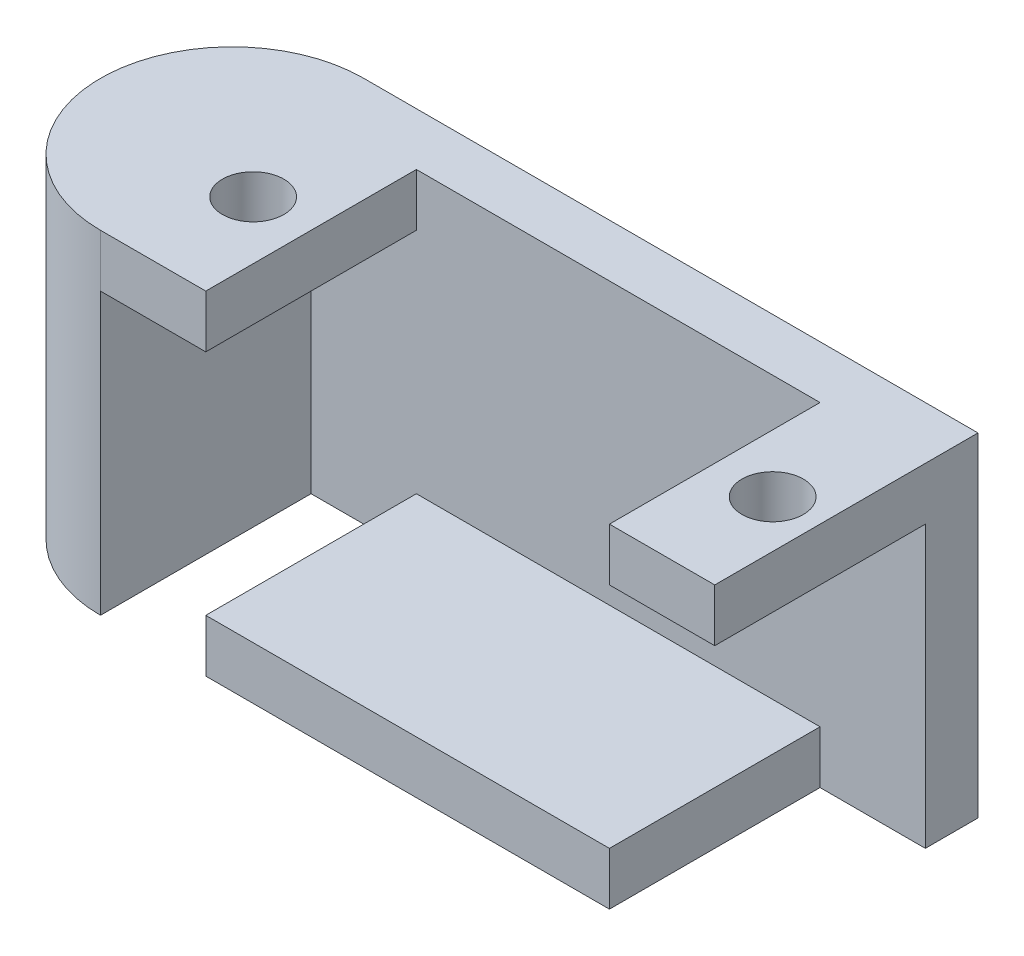
ISO-10303-21;
HEADER;
FILE_DESCRIPTION(('STEP AP214'),'2;1');
FILE_NAME('part.step','',(''),(''),'','','');
FILE_SCHEMA(('AUTOMOTIVE_DESIGN { 1 0 10303 214 1 1 1 1 }'));
ENDSEC;
DATA;
#1=APPLICATION_CONTEXT('core data for automotive mechanical design processes');
#2=APPLICATION_PROTOCOL_DEFINITION('international standard','automotive_design',2000,#1);
#3=PRODUCT_CONTEXT('',#1,'mechanical');
#4=PRODUCT('Part','Part','',(#3));
#5=PRODUCT_RELATED_PRODUCT_CATEGORY('part','',(#4));
#6=PRODUCT_DEFINITION_FORMATION('','',#4);
#7=PRODUCT_DEFINITION_CONTEXT('part definition',#1,'design');
#8=PRODUCT_DEFINITION('design','',#6,#7);
#9=PRODUCT_DEFINITION_SHAPE('','',#8);
#10=(LENGTH_UNIT() NAMED_UNIT(*) SI_UNIT(.MILLI.,.METRE.));
#11=(NAMED_UNIT(*) PLANE_ANGLE_UNIT() SI_UNIT($,.RADIAN.));
#12=(NAMED_UNIT(*) SI_UNIT($,.STERADIAN.) SOLID_ANGLE_UNIT());
#13=UNCERTAINTY_MEASURE_WITH_UNIT(LENGTH_MEASURE(1.E-05),#10,'distance_accuracy_value','');
#14=(GEOMETRIC_REPRESENTATION_CONTEXT(3) GLOBAL_UNCERTAINTY_ASSIGNED_CONTEXT((#13)) GLOBAL_UNIT_ASSIGNED_CONTEXT((#10,
#11,#12)) REPRESENTATION_CONTEXT('',''));
#15=CARTESIAN_POINT('',(0.,0.,0.));
#16=DIRECTION('',(0.,0.,1.));
#17=DIRECTION('',(1.,0.,0.));
#18=AXIS2_PLACEMENT_3D('',#15,#16,#17);
#19=CARTESIAN_POINT('',(0.,0.,-7.5));
#20=DIRECTION('',(0.,1.,0.));
#21=DIRECTION('',(0.,0.,1.));
#22=AXIS2_PLACEMENT_3D('',#19,#20,#21);
#23=PLANE('',#22);
#24=DIRECTION('',(1.,0.,0.));
#25=VECTOR('',#24,1.);
#26=CARTESIAN_POINT('',(35.,0.,-12.));
#27=LINE('',#26,#25);
#28=CARTESIAN_POINT('',(29.,0.,-12.));
#29=VERTEX_POINT('',#28);
#30=CARTESIAN_POINT('',(35.,0.,-12.));
#31=VERTEX_POINT('',#30);
#32=EDGE_CURVE('E191',#29,#31,#27,.T.);
#33=ORIENTED_EDGE('',*,*,#32,.F.);
#34=DIRECTION('',(0.,0.,1.));
#35=VECTOR('',#34,1.);
#36=CARTESIAN_POINT('',(29.,0.,-12.));
#37=LINE('',#36,#35);
#38=CARTESIAN_POINT('',(29.,0.,0.));
#39=VERTEX_POINT('',#38);
#40=EDGE_CURVE('E227',#29,#39,#37,.T.);
#41=ORIENTED_EDGE('',*,*,#40,.T.);
#42=DIRECTION('',(1.,0.,0.));
#43=VECTOR('',#42,1.);
#44=CARTESIAN_POINT('',(0.,0.,0.));
#45=LINE('',#44,#43);
#46=CARTESIAN_POINT('',(6.00000000000001,0.,0.));
#47=VERTEX_POINT('',#46);
#48=EDGE_CURVE('E248',#47,#39,#45,.T.);
#49=ORIENTED_EDGE('',*,*,#48,.F.);
#50=DIRECTION('',(0.,0.,1.));
#51=VECTOR('',#50,1.);
#52=CARTESIAN_POINT('',(6.00000000000001,0.,-12.));
#53=LINE('',#52,#51);
#54=CARTESIAN_POINT('',(6.00000000000001,0.,-12.));
#55=VERTEX_POINT('',#54);
#56=EDGE_CURVE('E234',#55,#47,#53,.T.);
#57=ORIENTED_EDGE('',*,*,#56,.F.);
#58=DIRECTION('',(1.,0.,0.));
#59=VECTOR('',#58,1.);
#60=CARTESIAN_POINT('',(6.00000000000001,0.,-12.));
#61=LINE('',#60,#59);
#62=CARTESIAN_POINT('',(0.,0.,-12.));
#63=VERTEX_POINT('',#62);
#64=EDGE_CURVE('E179',#63,#55,#61,.T.);
#65=ORIENTED_EDGE('',*,*,#64,.F.);
#66=DIRECTION('',(0.,0.,1.));
#67=VECTOR('',#66,1.);
#68=CARTESIAN_POINT('',(0.,0.,-12.));
#69=LINE('',#68,#67);
#70=CARTESIAN_POINT('',(0.,0.,0.));
#71=VERTEX_POINT('',#70);
#72=EDGE_CURVE('E47',#63,#71,#69,.T.);
#73=ORIENTED_EDGE('',*,*,#72,.T.);
#74=CARTESIAN_POINT('',(0.,0.,-7.5));
#75=DIRECTION('',(0.,1.,0.));
#76=DIRECTION('',(0.,0.,1.));
#77=AXIS2_PLACEMENT_3D('',#74,#75,#76);
#78=CIRCLE('',#77,7.5);
#79=CARTESIAN_POINT('',(0.,0.,-15.));
#80=VERTEX_POINT('',#79);
#81=EDGE_CURVE('E219',#80,#71,#78,.T.);
#82=ORIENTED_EDGE('',*,*,#81,.F.);
#83=DIRECTION('',(-1.,0.,0.));
#84=VECTOR('',#83,1.);
#85=CARTESIAN_POINT('',(0.,0.,-15.));
#86=LINE('',#85,#84);
#87=CARTESIAN_POINT('',(35.,0.,-15.));
#88=VERTEX_POINT('',#87);
#89=EDGE_CURVE('E71',#88,#80,#86,.T.);
#90=ORIENTED_EDGE('',*,*,#89,.F.);
#91=DIRECTION('',(0.,0.,-1.));
#92=VECTOR('',#91,1.);
#93=CARTESIAN_POINT('',(35.,0.,0.));
#94=LINE('',#93,#92);
#95=EDGE_CURVE('E251',#31,#88,#94,.T.);
#96=ORIENTED_EDGE('',*,*,#95,.F.);
#97=EDGE_LOOP('',(#33,#41,#49,#57,#65,#73,#82,#90,#96));
#98=FACE_BOUND('',#97,.T.);
#99=CARTESIAN_POINT('',(23.,0.,-6.));
#100=DIRECTION('',(0.,1.,0.));
#101=DIRECTION('',(0.,0.,1.));
#102=AXIS2_PLACEMENT_3D('',#99,#100,#101);
#103=CIRCLE('',#102,1.25);
#104=CARTESIAN_POINT('',(23.,0.,-4.75));
#105=VERTEX_POINT('',#104);
#106=EDGE_CURVE('E11',#105,#105,#103,.F.);
#107=ORIENTED_EDGE('',*,*,#106,.F.);
#108=EDGE_LOOP('',(#107));
#109=FACE_BOUND('',#108,.T.);
#110=ADVANCED_FACE('F32',(#98,#109),#23,.F.);
#111=CARTESIAN_POINT('',(0.,19.,0.));
#112=DIRECTION('',(0.,0.,-1.));
#113=DIRECTION('',(-1.,0.,0.));
#114=AXIS2_PLACEMENT_3D('',#111,#112,#113);
#115=PLANE('',#114);
#116=DIRECTION('',(1.,0.,0.));
#117=VECTOR('',#116,1.);
#118=CARTESIAN_POINT('',(0.,19.,0.));
#119=LINE('',#118,#117);
#120=CARTESIAN_POINT('',(29.,19.,0.));
#121=VERTEX_POINT('',#120);
#122=CARTESIAN_POINT('',(35.,19.,0.));
#123=VERTEX_POINT('',#122);
#124=EDGE_CURVE('E240',#121,#123,#119,.T.);
#125=ORIENTED_EDGE('',*,*,#124,.F.);
#126=DIRECTION('',(0.,1.,0.));
#127=VECTOR('',#126,1.);
#128=CARTESIAN_POINT('',(29.,19.,0.));
#129=LINE('',#128,#127);
#130=CARTESIAN_POINT('',(29.,16.,0.));
#131=VERTEX_POINT('',#130);
#132=EDGE_CURVE('E170',#131,#121,#129,.T.);
#133=ORIENTED_EDGE('',*,*,#132,.F.);
#134=DIRECTION('',(-1.,0.,0.));
#135=VECTOR('',#134,1.);
#136=CARTESIAN_POINT('',(29.,16.,0.));
#137=LINE('',#136,#135);
#138=CARTESIAN_POINT('',(35.,16.,0.));
#139=VERTEX_POINT('',#138);
#140=EDGE_CURVE('E172',#139,#131,#137,.T.);
#141=ORIENTED_EDGE('',*,*,#140,.F.);
#142=DIRECTION('',(0.,-1.,0.));
#143=VECTOR('',#142,1.);
#144=CARTESIAN_POINT('',(35.,19.,0.));
#145=LINE('',#144,#143);
#146=EDGE_CURVE('E257',#123,#139,#145,.T.);
#147=ORIENTED_EDGE('',*,*,#146,.F.);
#148=EDGE_LOOP('',(#125,#133,#141,#147));
#149=FACE_BOUND('',#148,.T.);
#150=ADVANCED_FACE('F286',(#149),#115,.F.);
#151=ORIENTED_EDGE('',*,*,#48,.T.);
#152=DIRECTION('',(0.,-1.,0.));
#153=VECTOR('',#152,1.);
#154=CARTESIAN_POINT('',(29.,0.,0.));
#155=LINE('',#154,#153);
#156=CARTESIAN_POINT('',(29.,3.,0.));
#157=VERTEX_POINT('',#156);
#158=EDGE_CURVE('E213',#157,#39,#155,.T.);
#159=ORIENTED_EDGE('',*,*,#158,.F.);
#160=DIRECTION('',(1.,0.,0.));
#161=VECTOR('',#160,1.);
#162=CARTESIAN_POINT('',(6.00000000000001,3.,0.));
#163=LINE('',#162,#161);
#164=CARTESIAN_POINT('',(6.00000000000001,3.,0.));
#165=VERTEX_POINT('',#164);
#166=EDGE_CURVE('E210',#165,#157,#163,.T.);
#167=ORIENTED_EDGE('',*,*,#166,.F.);
#168=DIRECTION('',(0.,1.,0.));
#169=VECTOR('',#168,1.);
#170=CARTESIAN_POINT('',(6.00000000000001,3.,0.));
#171=LINE('',#170,#169);
#172=EDGE_CURVE('E207',#47,#165,#171,.T.);
#173=ORIENTED_EDGE('',*,*,#172,.F.);
#174=EDGE_LOOP('',(#151,#159,#167,#173));
#175=FACE_BOUND('',#174,.T.);
#176=ADVANCED_FACE('F292',(#175),#115,.F.);
#177=CARTESIAN_POINT('',(0.,19.,-7.5));
#178=DIRECTION('',(0.,-1.,0.));
#179=DIRECTION('',(0.,0.,-1.));
#180=AXIS2_PLACEMENT_3D('',#177,#178,#179);
#181=CYLINDRICAL_SURFACE('',#180,7.5);
#182=ORIENTED_EDGE('',*,*,#81,.T.);
#183=DIRECTION('',(0.,-1.,0.));
#184=VECTOR('',#183,1.);
#185=CARTESIAN_POINT('',(0.,0.,0.));
#186=LINE('',#185,#184);
#187=CARTESIAN_POINT('',(0.,16.,0.));
#188=VERTEX_POINT('',#187);
#189=EDGE_CURVE('E205',#188,#71,#186,.T.);
#190=ORIENTED_EDGE('',*,*,#189,.F.);
#191=DIRECTION('',(0.,-1.,0.));
#192=VECTOR('',#191,1.);
#193=CARTESIAN_POINT('',(0.,19.,0.));
#194=LINE('',#193,#192);
#195=CARTESIAN_POINT('',(0.,19.,0.));
#196=VERTEX_POINT('',#195);
#197=EDGE_CURVE('E40',#196,#188,#194,.T.);
#198=ORIENTED_EDGE('',*,*,#197,.F.);
#199=CARTESIAN_POINT('',(0.,19.,-7.5));
#200=DIRECTION('',(0.,1.,0.));
#201=DIRECTION('',(0.,0.,1.));
#202=AXIS2_PLACEMENT_3D('',#199,#200,#201);
#203=CIRCLE('',#202,7.5);
#204=CARTESIAN_POINT('',(0.,19.,-15.));
#205=VERTEX_POINT('',#204);
#206=EDGE_CURVE('E238',#205,#196,#203,.T.);
#207=ORIENTED_EDGE('',*,*,#206,.F.);
#208=DIRECTION('',(0.,-1.,0.));
#209=VECTOR('',#208,1.);
#210=CARTESIAN_POINT('',(0.,19.,-15.));
#211=LINE('',#210,#209);
#212=EDGE_CURVE('E245',#205,#80,#211,.T.);
#213=ORIENTED_EDGE('',*,*,#212,.T.);
#214=EDGE_LOOP('',(#182,#190,#198,#207,#213));
#215=FACE_BOUND('',#214,.T.);
#216=ADVANCED_FACE('F34',(#215),#181,.T.);
#217=DIRECTION('',(-1.,0.,0.));
#218=VECTOR('',#217,1.);
#219=CARTESIAN_POINT('',(6.,16.,0.));
#220=LINE('',#219,#218);
#221=CARTESIAN_POINT('',(6.,16.,0.));
#222=VERTEX_POINT('',#221);
#223=EDGE_CURVE('E202',#222,#188,#220,.T.);
#224=ORIENTED_EDGE('',*,*,#223,.F.);
#225=DIRECTION('',(0.,-1.,0.));
#226=VECTOR('',#225,1.);
#227=CARTESIAN_POINT('',(6.00000000000001,19.,0.));
#228=LINE('',#227,#226);
#229=CARTESIAN_POINT('',(6.00000000000001,19.,0.));
#230=VERTEX_POINT('',#229);
#231=EDGE_CURVE('E153',#230,#222,#228,.T.);
#232=ORIENTED_EDGE('',*,*,#231,.F.);
#233=EDGE_CURVE('E79',#196,#230,#119,.T.);
#234=ORIENTED_EDGE('',*,*,#233,.F.);
#235=ORIENTED_EDGE('',*,*,#197,.T.);
#236=EDGE_LOOP('',(#224,#232,#234,#235));
#237=FACE_BOUND('',#236,.T.);
#238=ADVANCED_FACE('F294',(#237),#115,.F.);
#239=CARTESIAN_POINT('',(35.,19.,0.));
#240=DIRECTION('',(-1.,0.,0.));
#241=DIRECTION('',(0.,0.,1.));
#242=AXIS2_PLACEMENT_3D('',#239,#240,#241);
#243=PLANE('',#242);
#244=ORIENTED_EDGE('',*,*,#146,.T.);
#245=DIRECTION('',(0.,0.,1.));
#246=VECTOR('',#245,1.);
#247=CARTESIAN_POINT('',(35.,16.,-12.));
#248=LINE('',#247,#246);
#249=CARTESIAN_POINT('',(35.,16.,-12.));
#250=VERTEX_POINT('',#249);
#251=EDGE_CURVE('E225',#250,#139,#248,.T.);
#252=ORIENTED_EDGE('',*,*,#251,.F.);
#253=DIRECTION('',(0.,1.,0.));
#254=VECTOR('',#253,1.);
#255=CARTESIAN_POINT('',(35.,3.14477901188326,-12.));
#256=LINE('',#255,#254);
#257=EDGE_CURVE('E193',#31,#250,#256,.T.);
#258=ORIENTED_EDGE('',*,*,#257,.F.);
#259=ORIENTED_EDGE('',*,*,#95,.T.);
#260=DIRECTION('',(0.,-1.,0.));
#261=VECTOR('',#260,1.);
#262=CARTESIAN_POINT('',(35.,19.,-15.));
#263=LINE('',#262,#261);
#264=CARTESIAN_POINT('',(35.,19.,-15.));
#265=VERTEX_POINT('',#264);
#266=EDGE_CURVE('E255',#265,#88,#263,.T.);
#267=ORIENTED_EDGE('',*,*,#266,.F.);
#268=DIRECTION('',(0.,0.,-1.));
#269=VECTOR('',#268,1.);
#270=CARTESIAN_POINT('',(35.,19.,0.));
#271=LINE('',#270,#269);
#272=EDGE_CURVE('E242',#123,#265,#271,.T.);
#273=ORIENTED_EDGE('',*,*,#272,.F.);
#274=EDGE_LOOP('',(#244,#252,#258,#259,#267,#273));
#275=FACE_BOUND('',#274,.T.);
#276=ADVANCED_FACE('F303',(#275),#243,.F.);
#277=CARTESIAN_POINT('',(0.,19.,-15.));
#278=DIRECTION('',(0.,0.,1.));
#279=DIRECTION('',(1.,0.,0.));
#280=AXIS2_PLACEMENT_3D('',#277,#278,#279);
#281=PLANE('',#280);
#282=ORIENTED_EDGE('',*,*,#89,.T.);
#283=ORIENTED_EDGE('',*,*,#212,.F.);
#284=DIRECTION('',(-1.,0.,0.));
#285=VECTOR('',#284,1.);
#286=CARTESIAN_POINT('',(0.,19.,-15.));
#287=LINE('',#286,#285);
#288=EDGE_CURVE('E56',#265,#205,#287,.T.);
#289=ORIENTED_EDGE('',*,*,#288,.F.);
#290=ORIENTED_EDGE('',*,*,#266,.T.);
#291=EDGE_LOOP('',(#282,#283,#289,#290));
#292=FACE_BOUND('',#291,.T.);
#293=ADVANCED_FACE('F300',(#292),#281,.F.);
#294=CARTESIAN_POINT('',(0.,19.,-7.5));
#295=DIRECTION('',(0.,1.,0.));
#296=DIRECTION('',(0.,0.,1.));
#297=AXIS2_PLACEMENT_3D('',#294,#295,#296);
#298=PLANE('',#297);
#299=CARTESIAN_POINT('',(2.7,19.,-6.));
#300=DIRECTION('',(0.,1.,0.));
#301=DIRECTION('',(0.,0.,1.));
#302=AXIS2_PLACEMENT_3D('',#299,#300,#301);
#303=CIRCLE('',#302,1.75);
#304=CARTESIAN_POINT('',(2.7,19.,-4.25));
#305=VERTEX_POINT('',#304);
#306=EDGE_CURVE('E264',#305,#305,#303,.T.);
#307=ORIENTED_EDGE('',*,*,#306,.F.);
#308=EDGE_LOOP('',(#307));
#309=FACE_BOUND('',#308,.T.);
#310=CARTESIAN_POINT('',(32.3,19.,-6.));
#311=DIRECTION('',(0.,1.,0.));
#312=DIRECTION('',(0.,0.,1.));
#313=AXIS2_PLACEMENT_3D('',#310,#311,#312);
#314=CIRCLE('',#313,1.75);
#315=CARTESIAN_POINT('',(32.3,19.,-4.25));
#316=VERTEX_POINT('',#315);
#317=EDGE_CURVE('E175',#316,#316,#314,.T.);
#318=ORIENTED_EDGE('',*,*,#317,.F.);
#319=EDGE_LOOP('',(#318));
#320=FACE_BOUND('',#319,.T.);
#321=DIRECTION('',(0.,0.,1.));
#322=VECTOR('',#321,1.);
#323=CARTESIAN_POINT('',(6.00000000000001,19.,-12.));
#324=LINE('',#323,#322);
#325=CARTESIAN_POINT('',(6.00000000000001,19.,-12.));
#326=VERTEX_POINT('',#325);
#327=EDGE_CURVE('E217',#326,#230,#324,.T.);
#328=ORIENTED_EDGE('',*,*,#327,.F.);
#329=DIRECTION('',(-1.,0.,0.));
#330=VECTOR('',#329,1.);
#331=CARTESIAN_POINT('',(6.00000000000001,19.,-12.));
#332=LINE('',#331,#330);
#333=CARTESIAN_POINT('',(29.,19.,-12.));
#334=VERTEX_POINT('',#333);
#335=EDGE_CURVE('E158',#334,#326,#332,.T.);
#336=ORIENTED_EDGE('',*,*,#335,.F.);
#337=DIRECTION('',(0.,0.,1.));
#338=VECTOR('',#337,1.);
#339=CARTESIAN_POINT('',(29.,19.,-12.));
#340=LINE('',#339,#338);
#341=EDGE_CURVE('E220',#334,#121,#340,.T.);
#342=ORIENTED_EDGE('',*,*,#341,.T.);
#343=ORIENTED_EDGE('',*,*,#124,.T.);
#344=ORIENTED_EDGE('',*,*,#272,.T.);
#345=ORIENTED_EDGE('',*,*,#288,.T.);
#346=ORIENTED_EDGE('',*,*,#206,.T.);
#347=ORIENTED_EDGE('',*,*,#233,.T.);
#348=EDGE_LOOP('',(#328,#336,#342,#343,#344,#345,#346,#347));
#349=FACE_BOUND('',#348,.T.);
#350=ADVANCED_FACE('F298',(#309,#320,#349),#298,.T.);
#351=CARTESIAN_POINT('',(6.00000000000001,19.,-12.));
#352=DIRECTION('',(-1.,0.,0.));
#353=DIRECTION('',(0.,-1.,0.));
#354=AXIS2_PLACEMENT_3D('',#351,#352,#353);
#355=PLANE('',#354);
#356=ORIENTED_EDGE('',*,*,#231,.T.);
#357=DIRECTION('',(0.,0.,1.));
#358=VECTOR('',#357,1.);
#359=CARTESIAN_POINT('',(6.,16.,-12.));
#360=LINE('',#359,#358);
#361=CARTESIAN_POINT('',(6.,16.,-12.));
#362=VERTEX_POINT('',#361);
#363=EDGE_CURVE('E147',#362,#222,#360,.T.);
#364=ORIENTED_EDGE('',*,*,#363,.F.);
#365=DIRECTION('',(0.,-1.,0.));
#366=VECTOR('',#365,1.);
#367=CARTESIAN_POINT('',(6.00000000000001,19.,-12.));
#368=LINE('',#367,#366);
#369=EDGE_CURVE('E151',#326,#362,#368,.T.);
#370=ORIENTED_EDGE('',*,*,#369,.F.);
#371=ORIENTED_EDGE('',*,*,#327,.T.);
#372=EDGE_LOOP('',(#356,#364,#370,#371));
#373=FACE_BOUND('',#372,.T.);
#374=ADVANCED_FACE('F149',(#373),#355,.F.);
#375=CARTESIAN_POINT('',(29.,19.,-12.));
#376=DIRECTION('',(1.,0.,0.));
#377=DIRECTION('',(0.,0.,-1.));
#378=AXIS2_PLACEMENT_3D('',#375,#376,#377);
#379=PLANE('',#378);
#380=ORIENTED_EDGE('',*,*,#132,.T.);
#381=ORIENTED_EDGE('',*,*,#341,.F.);
#382=DIRECTION('',(0.,1.,0.));
#383=VECTOR('',#382,1.);
#384=CARTESIAN_POINT('',(29.,19.,-12.));
#385=LINE('',#384,#383);
#386=CARTESIAN_POINT('',(29.,16.,-12.));
#387=VERTEX_POINT('',#386);
#388=EDGE_CURVE('E198',#387,#334,#385,.T.);
#389=ORIENTED_EDGE('',*,*,#388,.F.);
#390=DIRECTION('',(0.,0.,1.));
#391=VECTOR('',#390,1.);
#392=CARTESIAN_POINT('',(29.,16.,-12.));
#393=LINE('',#392,#391);
#394=EDGE_CURVE('E223',#387,#131,#393,.T.);
#395=ORIENTED_EDGE('',*,*,#394,.T.);
#396=EDGE_LOOP('',(#380,#381,#389,#395));
#397=FACE_BOUND('',#396,.T.);
#398=ADVANCED_FACE('F345',(#397),#379,.F.);
#399=CARTESIAN_POINT('',(29.,16.,-12.));
#400=DIRECTION('',(0.,1.,0.));
#401=DIRECTION('',(0.,0.,1.));
#402=AXIS2_PLACEMENT_3D('',#399,#400,#401);
#403=PLANE('',#402);
#404=CARTESIAN_POINT('',(32.3,16.,-6.));
#405=DIRECTION('',(0.,1.,0.));
#406=DIRECTION('',(0.,0.,1.));
#407=AXIS2_PLACEMENT_3D('',#404,#405,#406);
#408=CIRCLE('',#407,1.75);
#409=CARTESIAN_POINT('',(32.3,16.,-4.25));
#410=VERTEX_POINT('',#409);
#411=EDGE_CURVE('E203',#410,#410,#408,.T.);
#412=ORIENTED_EDGE('',*,*,#411,.T.);
#413=EDGE_LOOP('',(#412));
#414=FACE_BOUND('',#413,.T.);
#415=ORIENTED_EDGE('',*,*,#140,.T.);
#416=ORIENTED_EDGE('',*,*,#394,.F.);
#417=DIRECTION('',(-1.,0.,0.));
#418=VECTOR('',#417,1.);
#419=CARTESIAN_POINT('',(29.,16.,-12.));
#420=LINE('',#419,#418);
#421=EDGE_CURVE('E195',#250,#387,#420,.T.);
#422=ORIENTED_EDGE('',*,*,#421,.F.);
#423=ORIENTED_EDGE('',*,*,#251,.T.);
#424=EDGE_LOOP('',(#415,#416,#422,#423));
#425=FACE_BOUND('',#424,.T.);
#426=ADVANCED_FACE('F340',(#414,#425),#403,.F.);
#427=CARTESIAN_POINT('',(29.,0.,-12.));
#428=DIRECTION('',(-1.,0.,0.));
#429=DIRECTION('',(0.,-1.,0.));
#430=AXIS2_PLACEMENT_3D('',#427,#428,#429);
#431=PLANE('',#430);
#432=ORIENTED_EDGE('',*,*,#158,.T.);
#433=ORIENTED_EDGE('',*,*,#40,.F.);
#434=DIRECTION('',(0.,-1.,0.));
#435=VECTOR('',#434,1.);
#436=CARTESIAN_POINT('',(29.,0.,-12.));
#437=LINE('',#436,#435);
#438=CARTESIAN_POINT('',(29.,3.,-12.));
#439=VERTEX_POINT('',#438);
#440=EDGE_CURVE('E188',#439,#29,#437,.T.);
#441=ORIENTED_EDGE('',*,*,#440,.F.);
#442=DIRECTION('',(0.,0.,1.));
#443=VECTOR('',#442,1.);
#444=CARTESIAN_POINT('',(29.,3.,-12.));
#445=LINE('',#444,#443);
#446=EDGE_CURVE('E230',#439,#157,#445,.T.);
#447=ORIENTED_EDGE('',*,*,#446,.T.);
#448=EDGE_LOOP('',(#432,#433,#441,#447));
#449=FACE_BOUND('',#448,.T.);
#450=ADVANCED_FACE('F324',(#449),#431,.F.);
#451=CARTESIAN_POINT('',(6.00000000000001,3.,-12.));
#452=DIRECTION('',(0.,-1.,0.));
#453=DIRECTION('',(1.,0.,0.));
#454=AXIS2_PLACEMENT_3D('',#451,#452,#453);
#455=PLANE('',#454);
#456=ORIENTED_EDGE('',*,*,#166,.T.);
#457=ORIENTED_EDGE('',*,*,#446,.F.);
#458=DIRECTION('',(1.,0.,0.));
#459=VECTOR('',#458,1.);
#460=CARTESIAN_POINT('',(6.00000000000001,3.,-12.));
#461=LINE('',#460,#459);
#462=CARTESIAN_POINT('',(6.00000000000001,3.,-12.));
#463=VERTEX_POINT('',#462);
#464=EDGE_CURVE('E185',#463,#439,#461,.T.);
#465=ORIENTED_EDGE('',*,*,#464,.F.);
#466=DIRECTION('',(0.,0.,1.));
#467=VECTOR('',#466,1.);
#468=CARTESIAN_POINT('',(6.00000000000001,3.,-12.));
#469=LINE('',#468,#467);
#470=EDGE_CURVE('E232',#463,#165,#469,.T.);
#471=ORIENTED_EDGE('',*,*,#470,.T.);
#472=EDGE_LOOP('',(#456,#457,#465,#471));
#473=FACE_BOUND('',#472,.T.);
#474=ADVANCED_FACE('F328',(#473),#455,.F.);
#475=CARTESIAN_POINT('',(6.00000000000001,3.,-12.));
#476=DIRECTION('',(1.,0.,0.));
#477=DIRECTION('',(0.,0.,-1.));
#478=AXIS2_PLACEMENT_3D('',#475,#476,#477);
#479=PLANE('',#478);
#480=ORIENTED_EDGE('',*,*,#172,.T.);
#481=ORIENTED_EDGE('',*,*,#470,.F.);
#482=DIRECTION('',(0.,1.,0.));
#483=VECTOR('',#482,1.);
#484=CARTESIAN_POINT('',(6.00000000000001,3.,-12.));
#485=LINE('',#484,#483);
#486=EDGE_CURVE('E182',#55,#463,#485,.T.);
#487=ORIENTED_EDGE('',*,*,#486,.F.);
#488=ORIENTED_EDGE('',*,*,#56,.T.);
#489=EDGE_LOOP('',(#480,#481,#487,#488));
#490=FACE_BOUND('',#489,.T.);
#491=ADVANCED_FACE('F330',(#490),#479,.F.);
#492=CARTESIAN_POINT('',(0.,0.,-12.));
#493=DIRECTION('',(-1.,0.,0.));
#494=DIRECTION('',(0.,-1.,0.));
#495=AXIS2_PLACEMENT_3D('',#492,#493,#494);
#496=PLANE('',#495);
#497=ORIENTED_EDGE('',*,*,#189,.T.);
#498=ORIENTED_EDGE('',*,*,#72,.F.);
#499=DIRECTION('',(0.,-1.,0.));
#500=VECTOR('',#499,1.);
#501=CARTESIAN_POINT('',(0.,3.82476488460703,-12.));
#502=LINE('',#501,#500);
#503=CARTESIAN_POINT('',(0.,16.,-12.));
#504=VERTEX_POINT('',#503);
#505=EDGE_CURVE('E164',#504,#63,#502,.T.);
#506=ORIENTED_EDGE('',*,*,#505,.F.);
#507=DIRECTION('',(0.,0.,1.));
#508=VECTOR('',#507,1.);
#509=CARTESIAN_POINT('',(0.,16.,-12.));
#510=LINE('',#509,#508);
#511=EDGE_CURVE('E157',#504,#188,#510,.T.);
#512=ORIENTED_EDGE('',*,*,#511,.T.);
#513=EDGE_LOOP('',(#497,#498,#506,#512));
#514=FACE_BOUND('',#513,.T.);
#515=ADVANCED_FACE('F376',(#514),#496,.F.);
#516=CARTESIAN_POINT('',(6.,16.,-12.));
#517=DIRECTION('',(0.,1.,0.));
#518=DIRECTION('',(-1.,0.,0.));
#519=AXIS2_PLACEMENT_3D('',#516,#517,#518);
#520=PLANE('',#519);
#521=CARTESIAN_POINT('',(2.7,16.,-6.));
#522=DIRECTION('',(0.,1.,0.));
#523=DIRECTION('',(-1.,0.,0.));
#524=AXIS2_PLACEMENT_3D('',#521,#522,#523);
#525=CIRCLE('',#524,1.75);
#526=CARTESIAN_POINT('',(0.950000000000005,16.,-6.));
#527=VERTEX_POINT('',#526);
#528=EDGE_CURVE('E262',#527,#527,#525,.T.);
#529=ORIENTED_EDGE('',*,*,#528,.T.);
#530=EDGE_LOOP('',(#529));
#531=FACE_BOUND('',#530,.T.);
#532=ORIENTED_EDGE('',*,*,#223,.T.);
#533=ORIENTED_EDGE('',*,*,#511,.F.);
#534=DIRECTION('',(-1.,0.,0.));
#535=VECTOR('',#534,1.);
#536=CARTESIAN_POINT('',(6.,16.,-12.));
#537=LINE('',#536,#535);
#538=EDGE_CURVE('E161',#362,#504,#537,.T.);
#539=ORIENTED_EDGE('',*,*,#538,.F.);
#540=ORIENTED_EDGE('',*,*,#363,.T.);
#541=EDGE_LOOP('',(#532,#533,#539,#540));
#542=FACE_BOUND('',#541,.T.);
#543=ADVANCED_FACE('F162',(#531,#542),#520,.F.);
#544=CARTESIAN_POINT('',(0.,0.,-12.));
#545=DIRECTION('',(0.,0.,-1.));
#546=DIRECTION('',(-1.,0.,0.));
#547=AXIS2_PLACEMENT_3D('',#544,#545,#546);
#548=PLANE('',#547);
#549=ORIENTED_EDGE('',*,*,#369,.T.);
#550=ORIENTED_EDGE('',*,*,#538,.T.);
#551=ORIENTED_EDGE('',*,*,#505,.T.);
#552=ORIENTED_EDGE('',*,*,#64,.T.);
#553=ORIENTED_EDGE('',*,*,#486,.T.);
#554=ORIENTED_EDGE('',*,*,#464,.T.);
#555=ORIENTED_EDGE('',*,*,#440,.T.);
#556=ORIENTED_EDGE('',*,*,#32,.T.);
#557=ORIENTED_EDGE('',*,*,#257,.T.);
#558=ORIENTED_EDGE('',*,*,#421,.T.);
#559=ORIENTED_EDGE('',*,*,#388,.T.);
#560=ORIENTED_EDGE('',*,*,#335,.T.);
#561=EDGE_LOOP('',(#549,#550,#551,#552,#553,#554,#555,#556,#557,#558,#559,#560));
#562=FACE_BOUND('',#561,.T.);
#563=ADVANCED_FACE('F166',(#562),#548,.F.);
#564=CARTESIAN_POINT('',(32.3,7.,-6.));
#565=DIRECTION('',(0.,1.,0.));
#566=DIRECTION('',(0.,0.,1.));
#567=AXIS2_PLACEMENT_3D('',#564,#565,#566);
#568=CYLINDRICAL_SURFACE('',#567,1.75);
#569=ORIENTED_EDGE('',*,*,#317,.T.);
#570=EDGE_LOOP('',(#569));
#571=FACE_BOUND('',#570,.T.);
#572=ORIENTED_EDGE('',*,*,#411,.F.);
#573=EDGE_LOOP('',(#572));
#574=FACE_BOUND('',#573,.T.);
#575=ADVANCED_FACE('F356',(#571,#574),#568,.F.);
#576=CARTESIAN_POINT('',(2.7,7.,-6.));
#577=DIRECTION('',(0.,1.,0.));
#578=DIRECTION('',(0.,0.,1.));
#579=AXIS2_PLACEMENT_3D('',#576,#577,#578);
#580=CYLINDRICAL_SURFACE('',#579,1.75);
#581=ORIENTED_EDGE('',*,*,#306,.T.);
#582=EDGE_LOOP('',(#581));
#583=FACE_BOUND('',#582,.T.);
#584=ORIENTED_EDGE('',*,*,#528,.F.);
#585=EDGE_LOOP('',(#584));
#586=FACE_BOUND('',#585,.T.);
#587=ADVANCED_FACE('F281',(#583,#586),#580,.F.);
#588=CARTESIAN_POINT('',(23.,-3.,-6.));
#589=DIRECTION('',(0.,1.,0.));
#590=DIRECTION('',(0.,0.,1.));
#591=AXIS2_PLACEMENT_3D('',#588,#589,#590);
#592=CYLINDRICAL_SURFACE('',#591,1.25);
#593=CARTESIAN_POINT('',(23.,-3.,-6.));
#594=DIRECTION('',(0.,-1.,0.));
#595=DIRECTION('',(0.,0.,-1.));
#596=AXIS2_PLACEMENT_3D('',#593,#594,#595);
#597=CIRCLE('',#596,1.25);
#598=CARTESIAN_POINT('',(23.,-3.,-7.25));
#599=VERTEX_POINT('',#598);
#600=EDGE_CURVE('E269',#599,#599,#597,.T.);
#601=ORIENTED_EDGE('',*,*,#600,.F.);
#602=EDGE_LOOP('',(#601));
#603=FACE_BOUND('',#602,.T.);
#604=ORIENTED_EDGE('',*,*,#106,.T.);
#605=EDGE_LOOP('',(#604));
#606=FACE_BOUND('',#605,.T.);
#607=ADVANCED_FACE('F278',(#603,#606),#592,.T.);
#608=CARTESIAN_POINT('',(23.,-3.,-6.));
#609=DIRECTION('',(0.,-1.,0.));
#610=DIRECTION('',(0.,0.,-1.));
#611=AXIS2_PLACEMENT_3D('',#608,#609,#610);
#612=PLANE('',#611);
#613=ORIENTED_EDGE('',*,*,#600,.T.);
#614=EDGE_LOOP('',(#613));
#615=FACE_BOUND('',#614,.T.);
#616=ADVANCED_FACE('F276',(#615),#612,.T.);
#617=CLOSED_SHELL('',(#110,#150,#176,#216,#238,#276,#293,#350,#374,#398,#426,#450,#474,#491,
#515,#543,#563,#575,#587,#607,#616));
#618=MANIFOLD_SOLID_BREP('B2',#617);
#619=ADVANCED_BREP_SHAPE_REPRESENTATION('',(#18,#618),#14);
#620=SHAPE_DEFINITION_REPRESENTATION(#9,#619);
ENDSEC;
END-ISO-10303-21;
